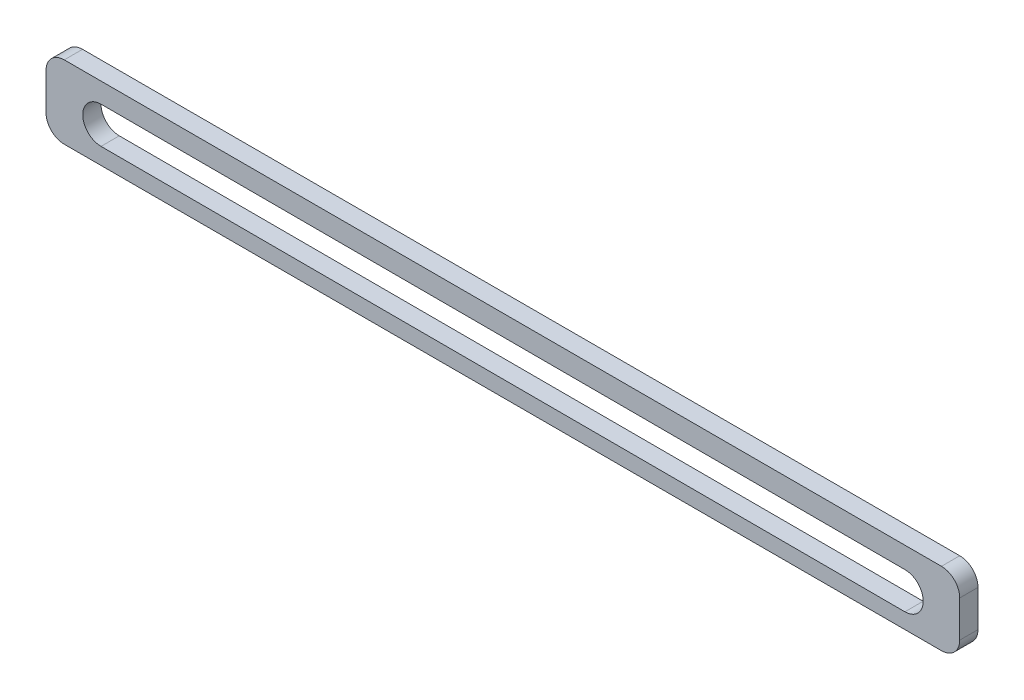
ISO-10303-21;
HEADER;
FILE_DESCRIPTION(('STEP AP214'),'2;1');
FILE_NAME('part.step','',(''),(''),'','','');
FILE_SCHEMA(('AUTOMOTIVE_DESIGN { 1 0 10303 214 1 1 1 1 }'));
ENDSEC;
DATA;
#1=APPLICATION_CONTEXT('core data for automotive mechanical design processes');
#2=APPLICATION_PROTOCOL_DEFINITION('international standard','automotive_design',2000,#1);
#3=PRODUCT_CONTEXT('',#1,'mechanical');
#4=PRODUCT('Part','Part','',(#3));
#5=PRODUCT_RELATED_PRODUCT_CATEGORY('part','',(#4));
#6=PRODUCT_DEFINITION_FORMATION('','',#4);
#7=PRODUCT_DEFINITION_CONTEXT('part definition',#1,'design');
#8=PRODUCT_DEFINITION('design','',#6,#7);
#9=PRODUCT_DEFINITION_SHAPE('','',#8);
#10=(LENGTH_UNIT() NAMED_UNIT(*) SI_UNIT(.MILLI.,.METRE.));
#11=(NAMED_UNIT(*) PLANE_ANGLE_UNIT() SI_UNIT($,.RADIAN.));
#12=(NAMED_UNIT(*) SI_UNIT($,.STERADIAN.) SOLID_ANGLE_UNIT());
#13=UNCERTAINTY_MEASURE_WITH_UNIT(LENGTH_MEASURE(1.E-05),#10,'distance_accuracy_value','');
#14=(GEOMETRIC_REPRESENTATION_CONTEXT(3) GLOBAL_UNCERTAINTY_ASSIGNED_CONTEXT((#13)) GLOBAL_UNIT_ASSIGNED_CONTEXT((#10,
#11,#12)) REPRESENTATION_CONTEXT('',''));
#15=CARTESIAN_POINT('',(0.,0.,0.));
#16=DIRECTION('',(0.,0.,1.));
#17=DIRECTION('',(1.,0.,0.));
#18=AXIS2_PLACEMENT_3D('',#15,#16,#17);
#19=CARTESIAN_POINT('',(290.,123.262074110531,5.));
#20=DIRECTION('',(0.,0.,1.));
#21=DIRECTION('',(1.,0.,0.));
#22=AXIS2_PLACEMENT_3D('',#19,#20,#21);
#23=PLANE('',#22);
#24=CARTESIAN_POINT('',(290.,123.262074110531,5.));
#25=DIRECTION('',(0.,0.,1.));
#26=DIRECTION('',(1.,0.,0.));
#27=AXIS2_PLACEMENT_3D('',#24,#25,#26);
#28=CIRCLE('',#27,10.);
#29=CARTESIAN_POINT('',(290.,113.262074110531,5.));
#30=VERTEX_POINT('',#29);
#31=CARTESIAN_POINT('',(300.,123.262074110531,5.));
#32=VERTEX_POINT('',#31);
#33=EDGE_CURVE('E157',#30,#32,#28,.T.);
#34=ORIENTED_EDGE('',*,*,#33,.T.);
#35=DIRECTION('',(0.,1.,0.));
#36=VECTOR('',#35,1.);
#37=CARTESIAN_POINT('',(300.,143.262074110531,5.));
#38=LINE('',#37,#36);
#39=CARTESIAN_POINT('',(300.,143.262074110531,5.));
#40=VERTEX_POINT('',#39);
#41=EDGE_CURVE('E160',#32,#40,#38,.T.);
#42=ORIENTED_EDGE('',*,*,#41,.T.);
#43=CARTESIAN_POINT('',(290.,143.262074110531,5.));
#44=DIRECTION('',(0.,0.,1.));
#45=DIRECTION('',(-1.,0.,0.));
#46=AXIS2_PLACEMENT_3D('',#43,#44,#45);
#47=CIRCLE('',#46,10.);
#48=CARTESIAN_POINT('',(290.,153.262074110531,5.));
#49=VERTEX_POINT('',#48);
#50=EDGE_CURVE('E163',#40,#49,#47,.T.);
#51=ORIENTED_EDGE('',*,*,#50,.T.);
#52=DIRECTION('',(-1.,0.,0.));
#53=VECTOR('',#52,1.);
#54=CARTESIAN_POINT('',(-190.,153.262074110531,5.));
#55=LINE('',#54,#53);
#56=CARTESIAN_POINT('',(-190.,153.262074110531,5.));
#57=VERTEX_POINT('',#56);
#58=EDGE_CURVE('E165',#49,#57,#55,.T.);
#59=ORIENTED_EDGE('',*,*,#58,.T.);
#60=CARTESIAN_POINT('',(-190.,143.262074110531,5.));
#61=DIRECTION('',(0.,0.,1.));
#62=DIRECTION('',(1.,0.,0.));
#63=AXIS2_PLACEMENT_3D('',#60,#61,#62);
#64=CIRCLE('',#63,9.99999999999999);
#65=CARTESIAN_POINT('',(-200.,143.262074110531,5.));
#66=VERTEX_POINT('',#65);
#67=EDGE_CURVE('E167',#57,#66,#64,.T.);
#68=ORIENTED_EDGE('',*,*,#67,.T.);
#69=DIRECTION('',(0.,-1.,0.));
#70=VECTOR('',#69,1.);
#71=CARTESIAN_POINT('',(-200.,143.262074110531,5.));
#72=LINE('',#71,#70);
#73=CARTESIAN_POINT('',(-200.,123.262074110531,5.));
#74=VERTEX_POINT('',#73);
#75=EDGE_CURVE('E169',#66,#74,#72,.T.);
#76=ORIENTED_EDGE('',*,*,#75,.T.);
#77=CARTESIAN_POINT('',(-190.,123.262074110531,5.));
#78=DIRECTION('',(0.,0.,1.));
#79=DIRECTION('',(1.,0.,0.));
#80=AXIS2_PLACEMENT_3D('',#77,#78,#79);
#81=CIRCLE('',#80,10.);
#82=CARTESIAN_POINT('',(-190.,113.262074110531,5.));
#83=VERTEX_POINT('',#82);
#84=EDGE_CURVE('E171',#74,#83,#81,.T.);
#85=ORIENTED_EDGE('',*,*,#84,.T.);
#86=DIRECTION('',(1.,0.,0.));
#87=VECTOR('',#86,1.);
#88=CARTESIAN_POINT('',(-190.,113.262074110531,5.));
#89=LINE('',#88,#87);
#90=EDGE_CURVE('E173',#83,#30,#89,.T.);
#91=ORIENTED_EDGE('',*,*,#90,.T.);
#92=EDGE_LOOP('',(#34,#42,#51,#59,#68,#76,#85,#91));
#93=FACE_BOUND('',#92,.T.);
#94=DIRECTION('',(0.999999005334886,-0.00141043583263051,0.));
#95=VECTOR('',#94,1.);
#96=CARTESIAN_POINT('',(-169.895525103664,122.322633631603,5.));
#97=LINE('',#96,#95);
#98=CARTESIAN_POINT('',(-169.895525103664,122.322633631603,5.));
#99=VERTEX_POINT('',#98);
#100=CARTESIAN_POINT('',(270.004302633349,121.702182534653,5.));
#101=VERTEX_POINT('',#100);
#102=EDGE_CURVE('E129',#99,#101,#97,.T.);
#103=ORIENTED_EDGE('',*,*,#102,.F.);
#104=CARTESIAN_POINT('',(-169.881420745337,132.322623684951,5.));
#105=DIRECTION('',(0.,0.,1.));
#106=DIRECTION('',(1.,0.,0.));
#107=AXIS2_PLACEMENT_3D('',#104,#105,#106);
#108=CIRCLE('',#107,10.);
#109=CARTESIAN_POINT('',(-169.867316387011,142.3226137383,5.));
#110=VERTEX_POINT('',#109);
#111=EDGE_CURVE('E121',#110,#99,#108,.T.);
#112=ORIENTED_EDGE('',*,*,#111,.F.);
#113=DIRECTION('',(-0.999999005334886,0.00141043583263051,0.));
#114=VECTOR('',#113,1.);
#115=CARTESIAN_POINT('',(-169.867316387011,142.3226137383,5.));
#116=LINE('',#115,#114);
#117=CARTESIAN_POINT('',(270.032511350002,141.702162641351,5.));
#118=VERTEX_POINT('',#117);
#119=EDGE_CURVE('E143',#118,#110,#116,.T.);
#120=ORIENTED_EDGE('',*,*,#119,.F.);
#121=CARTESIAN_POINT('',(270.018406991675,131.702172588002,5.));
#122=DIRECTION('',(0.,0.,1.));
#123=DIRECTION('',(1.,0.,0.));
#124=AXIS2_PLACEMENT_3D('',#121,#122,#123);
#125=CIRCLE('',#124,10.);
#126=EDGE_CURVE('E141',#101,#118,#125,.T.);
#127=ORIENTED_EDGE('',*,*,#126,.F.);
#128=EDGE_LOOP('',(#103,#112,#120,#127));
#129=FACE_BOUND('',#128,.T.);
#130=ADVANCED_FACE('F32',(#93,#129),#23,.T.);
#131=CARTESIAN_POINT('',(290.,123.262074110531,-5.));
#132=DIRECTION('',(0.,0.,1.));
#133=DIRECTION('',(1.,0.,0.));
#134=AXIS2_PLACEMENT_3D('',#131,#132,#133);
#135=PLANE('',#134);
#136=CARTESIAN_POINT('',(290.,123.262074110531,-5.));
#137=DIRECTION('',(0.,0.,1.));
#138=DIRECTION('',(1.,0.,0.));
#139=AXIS2_PLACEMENT_3D('',#136,#137,#138);
#140=CIRCLE('',#139,10.);
#141=CARTESIAN_POINT('',(290.,113.262074110531,-5.));
#142=VERTEX_POINT('',#141);
#143=CARTESIAN_POINT('',(300.,123.262074110531,-5.));
#144=VERTEX_POINT('',#143);
#145=EDGE_CURVE('E137',#142,#144,#140,.T.);
#146=ORIENTED_EDGE('',*,*,#145,.F.);
#147=DIRECTION('',(1.,0.,0.));
#148=VECTOR('',#147,1.);
#149=CARTESIAN_POINT('',(-190.,113.262074110531,-5.));
#150=LINE('',#149,#148);
#151=CARTESIAN_POINT('',(-190.,113.262074110531,-5.));
#152=VERTEX_POINT('',#151);
#153=EDGE_CURVE('E161',#152,#142,#150,.T.);
#154=ORIENTED_EDGE('',*,*,#153,.F.);
#155=CARTESIAN_POINT('',(-190.,123.262074110531,-5.));
#156=DIRECTION('',(0.,0.,1.));
#157=DIRECTION('',(1.,0.,0.));
#158=AXIS2_PLACEMENT_3D('',#155,#156,#157);
#159=CIRCLE('',#158,10.);
#160=CARTESIAN_POINT('',(-200.,123.262074110531,-5.));
#161=VERTEX_POINT('',#160);
#162=EDGE_CURVE('E188',#161,#152,#159,.T.);
#163=ORIENTED_EDGE('',*,*,#162,.F.);
#164=DIRECTION('',(0.,-1.,0.));
#165=VECTOR('',#164,1.);
#166=CARTESIAN_POINT('',(-200.,143.262074110531,-5.));
#167=LINE('',#166,#165);
#168=CARTESIAN_POINT('',(-200.,143.262074110531,-5.));
#169=VERTEX_POINT('',#168);
#170=EDGE_CURVE('E186',#169,#161,#167,.T.);
#171=ORIENTED_EDGE('',*,*,#170,.F.);
#172=CARTESIAN_POINT('',(-190.,143.262074110531,-5.));
#173=DIRECTION('',(0.,0.,1.));
#174=DIRECTION('',(1.,0.,0.));
#175=AXIS2_PLACEMENT_3D('',#172,#173,#174);
#176=CIRCLE('',#175,9.99999999999999);
#177=CARTESIAN_POINT('',(-190.,153.262074110531,-5.));
#178=VERTEX_POINT('',#177);
#179=EDGE_CURVE('E184',#178,#169,#176,.T.);
#180=ORIENTED_EDGE('',*,*,#179,.F.);
#181=DIRECTION('',(-1.,0.,0.));
#182=VECTOR('',#181,1.);
#183=CARTESIAN_POINT('',(-190.,153.262074110531,-5.));
#184=LINE('',#183,#182);
#185=CARTESIAN_POINT('',(290.,153.262074110531,-5.));
#186=VERTEX_POINT('',#185);
#187=EDGE_CURVE('E182',#186,#178,#184,.T.);
#188=ORIENTED_EDGE('',*,*,#187,.F.);
#189=CARTESIAN_POINT('',(290.,143.262074110531,-5.));
#190=DIRECTION('',(0.,0.,1.));
#191=DIRECTION('',(-1.,0.,0.));
#192=AXIS2_PLACEMENT_3D('',#189,#190,#191);
#193=CIRCLE('',#192,10.);
#194=CARTESIAN_POINT('',(300.,143.262074110531,-5.));
#195=VERTEX_POINT('',#194);
#196=EDGE_CURVE('E180',#195,#186,#193,.T.);
#197=ORIENTED_EDGE('',*,*,#196,.F.);
#198=DIRECTION('',(0.,1.,0.));
#199=VECTOR('',#198,1.);
#200=CARTESIAN_POINT('',(300.,143.262074110531,-5.));
#201=LINE('',#200,#199);
#202=EDGE_CURVE('E178',#144,#195,#201,.T.);
#203=ORIENTED_EDGE('',*,*,#202,.F.);
#204=EDGE_LOOP('',(#146,#154,#163,#171,#180,#188,#197,#203));
#205=FACE_BOUND('',#204,.T.);
#206=CARTESIAN_POINT('',(-169.881420745337,132.322623684951,-5.));
#207=DIRECTION('',(0.,0.,1.));
#208=DIRECTION('',(1.,0.,0.));
#209=AXIS2_PLACEMENT_3D('',#206,#207,#208);
#210=CIRCLE('',#209,10.);
#211=CARTESIAN_POINT('',(-169.867316387011,142.3226137383,-5.));
#212=VERTEX_POINT('',#211);
#213=CARTESIAN_POINT('',(-169.895525103664,122.322633631603,-5.));
#214=VERTEX_POINT('',#213);
#215=EDGE_CURVE('E55',#212,#214,#210,.T.);
#216=ORIENTED_EDGE('',*,*,#215,.T.);
#217=DIRECTION('',(0.999999005334886,-0.00141043583263051,0.));
#218=VECTOR('',#217,1.);
#219=CARTESIAN_POINT('',(-169.895525103664,122.322633631603,-5.));
#220=LINE('',#219,#218);
#221=CARTESIAN_POINT('',(270.004302633349,121.702182534653,-5.));
#222=VERTEX_POINT('',#221);
#223=EDGE_CURVE('E136',#214,#222,#220,.T.);
#224=ORIENTED_EDGE('',*,*,#223,.T.);
#225=CARTESIAN_POINT('',(270.018406991675,131.702172588002,-5.));
#226=DIRECTION('',(0.,0.,1.));
#227=DIRECTION('',(1.,0.,0.));
#228=AXIS2_PLACEMENT_3D('',#225,#226,#227);
#229=CIRCLE('',#228,10.);
#230=CARTESIAN_POINT('',(270.032511350002,141.702162641351,-5.));
#231=VERTEX_POINT('',#230);
#232=EDGE_CURVE('E149',#222,#231,#229,.T.);
#233=ORIENTED_EDGE('',*,*,#232,.T.);
#234=DIRECTION('',(-0.999999005334886,0.00141043583263051,0.));
#235=VECTOR('',#234,1.);
#236=CARTESIAN_POINT('',(-169.867316387011,142.3226137383,-5.));
#237=LINE('',#236,#235);
#238=EDGE_CURVE('E130',#231,#212,#237,.T.);
#239=ORIENTED_EDGE('',*,*,#238,.T.);
#240=EDGE_LOOP('',(#216,#224,#233,#239));
#241=FACE_BOUND('',#240,.T.);
#242=ADVANCED_FACE('F218',(#205,#241),#135,.F.);
#243=CARTESIAN_POINT('',(290.,123.262074110531,5.));
#244=DIRECTION('',(0.,0.,-1.));
#245=DIRECTION('',(-1.,0.,0.));
#246=AXIS2_PLACEMENT_3D('',#243,#244,#245);
#247=CYLINDRICAL_SURFACE('',#246,10.);
#248=ORIENTED_EDGE('',*,*,#145,.T.);
#249=DIRECTION('',(0.,0.,-1.));
#250=VECTOR('',#249,1.);
#251=CARTESIAN_POINT('',(300.,123.262074110531,5.));
#252=LINE('',#251,#250);
#253=EDGE_CURVE('E11',#32,#144,#252,.T.);
#254=ORIENTED_EDGE('',*,*,#253,.F.);
#255=ORIENTED_EDGE('',*,*,#33,.F.);
#256=DIRECTION('',(0.,0.,-1.));
#257=VECTOR('',#256,1.);
#258=CARTESIAN_POINT('',(290.,113.262074110531,5.));
#259=LINE('',#258,#257);
#260=EDGE_CURVE('E175',#30,#142,#259,.T.);
#261=ORIENTED_EDGE('',*,*,#260,.T.);
#262=EDGE_LOOP('',(#248,#254,#255,#261));
#263=FACE_BOUND('',#262,.T.);
#264=ADVANCED_FACE('F34',(#263),#247,.T.);
#265=CARTESIAN_POINT('',(300.,143.262074110531,5.));
#266=DIRECTION('',(-1.,0.,0.));
#267=DIRECTION('',(0.,0.,1.));
#268=AXIS2_PLACEMENT_3D('',#265,#266,#267);
#269=PLANE('',#268);
#270=ORIENTED_EDGE('',*,*,#202,.T.);
#271=DIRECTION('',(0.,0.,-1.));
#272=VECTOR('',#271,1.);
#273=CARTESIAN_POINT('',(300.,143.262074110531,5.));
#274=LINE('',#273,#272);
#275=EDGE_CURVE('E40',#40,#195,#274,.T.);
#276=ORIENTED_EDGE('',*,*,#275,.F.);
#277=ORIENTED_EDGE('',*,*,#41,.F.);
#278=ORIENTED_EDGE('',*,*,#253,.T.);
#279=EDGE_LOOP('',(#270,#276,#277,#278));
#280=FACE_BOUND('',#279,.T.);
#281=ADVANCED_FACE('F235',(#280),#269,.F.);
#282=CARTESIAN_POINT('',(290.,143.262074110531,5.));
#283=DIRECTION('',(0.,0.,-1.));
#284=DIRECTION('',(-1.,0.,0.));
#285=AXIS2_PLACEMENT_3D('',#282,#283,#284);
#286=CYLINDRICAL_SURFACE('',#285,10.);
#287=ORIENTED_EDGE('',*,*,#196,.T.);
#288=DIRECTION('',(0.,0.,-1.));
#289=VECTOR('',#288,1.);
#290=CARTESIAN_POINT('',(290.,153.262074110531,5.));
#291=LINE('',#290,#289);
#292=EDGE_CURVE('E205',#49,#186,#291,.T.);
#293=ORIENTED_EDGE('',*,*,#292,.F.);
#294=ORIENTED_EDGE('',*,*,#50,.F.);
#295=ORIENTED_EDGE('',*,*,#275,.T.);
#296=EDGE_LOOP('',(#287,#293,#294,#295));
#297=FACE_BOUND('',#296,.T.);
#298=ADVANCED_FACE('F212',(#297),#286,.T.);
#299=CARTESIAN_POINT('',(-190.,153.262074110531,5.));
#300=DIRECTION('',(0.,-1.,0.));
#301=DIRECTION('',(1.,0.,0.));
#302=AXIS2_PLACEMENT_3D('',#299,#300,#301);
#303=PLANE('',#302);
#304=ORIENTED_EDGE('',*,*,#187,.T.);
#305=DIRECTION('',(0.,0.,-1.));
#306=VECTOR('',#305,1.);
#307=CARTESIAN_POINT('',(-190.,153.262074110531,5.));
#308=LINE('',#307,#306);
#309=EDGE_CURVE('E202',#57,#178,#308,.T.);
#310=ORIENTED_EDGE('',*,*,#309,.F.);
#311=ORIENTED_EDGE('',*,*,#58,.F.);
#312=ORIENTED_EDGE('',*,*,#292,.T.);
#313=EDGE_LOOP('',(#304,#310,#311,#312));
#314=FACE_BOUND('',#313,.T.);
#315=ADVANCED_FACE('F224',(#314),#303,.F.);
#316=CARTESIAN_POINT('',(-190.,143.262074110531,5.));
#317=DIRECTION('',(0.,0.,-1.));
#318=DIRECTION('',(-1.,0.,0.));
#319=AXIS2_PLACEMENT_3D('',#316,#317,#318);
#320=CYLINDRICAL_SURFACE('',#319,9.99999999999999);
#321=ORIENTED_EDGE('',*,*,#179,.T.);
#322=DIRECTION('',(0.,0.,-1.));
#323=VECTOR('',#322,1.);
#324=CARTESIAN_POINT('',(-200.,143.262074110531,5.));
#325=LINE('',#324,#323);
#326=EDGE_CURVE('E199',#66,#169,#325,.T.);
#327=ORIENTED_EDGE('',*,*,#326,.F.);
#328=ORIENTED_EDGE('',*,*,#67,.F.);
#329=ORIENTED_EDGE('',*,*,#309,.T.);
#330=EDGE_LOOP('',(#321,#327,#328,#329));
#331=FACE_BOUND('',#330,.T.);
#332=ADVANCED_FACE('F228',(#331),#320,.T.);
#333=CARTESIAN_POINT('',(-200.,143.262074110531,5.));
#334=DIRECTION('',(1.,0.,0.));
#335=DIRECTION('',(0.,0.,-1.));
#336=AXIS2_PLACEMENT_3D('',#333,#334,#335);
#337=PLANE('',#336);
#338=ORIENTED_EDGE('',*,*,#170,.T.);
#339=DIRECTION('',(0.,0.,-1.));
#340=VECTOR('',#339,1.);
#341=CARTESIAN_POINT('',(-200.,123.262074110531,5.));
#342=LINE('',#341,#340);
#343=EDGE_CURVE('E196',#74,#161,#342,.T.);
#344=ORIENTED_EDGE('',*,*,#343,.F.);
#345=ORIENTED_EDGE('',*,*,#75,.F.);
#346=ORIENTED_EDGE('',*,*,#326,.T.);
#347=EDGE_LOOP('',(#338,#344,#345,#346));
#348=FACE_BOUND('',#347,.T.);
#349=ADVANCED_FACE('F248',(#348),#337,.F.);
#350=CARTESIAN_POINT('',(-190.,123.262074110531,5.));
#351=DIRECTION('',(0.,0.,-1.));
#352=DIRECTION('',(-1.,0.,0.));
#353=AXIS2_PLACEMENT_3D('',#350,#351,#352);
#354=CYLINDRICAL_SURFACE('',#353,10.);
#355=ORIENTED_EDGE('',*,*,#162,.T.);
#356=DIRECTION('',(0.,0.,-1.));
#357=VECTOR('',#356,1.);
#358=CARTESIAN_POINT('',(-190.,113.262074110531,5.));
#359=LINE('',#358,#357);
#360=EDGE_CURVE('E193',#83,#152,#359,.T.);
#361=ORIENTED_EDGE('',*,*,#360,.F.);
#362=ORIENTED_EDGE('',*,*,#84,.F.);
#363=ORIENTED_EDGE('',*,*,#343,.T.);
#364=EDGE_LOOP('',(#355,#361,#362,#363));
#365=FACE_BOUND('',#364,.T.);
#366=ADVANCED_FACE('F246',(#365),#354,.T.);
#367=CARTESIAN_POINT('',(-190.,113.262074110531,5.));
#368=DIRECTION('',(0.,1.,0.));
#369=DIRECTION('',(0.,0.,1.));
#370=AXIS2_PLACEMENT_3D('',#367,#368,#369);
#371=PLANE('',#370);
#372=ORIENTED_EDGE('',*,*,#153,.T.);
#373=ORIENTED_EDGE('',*,*,#260,.F.);
#374=ORIENTED_EDGE('',*,*,#90,.F.);
#375=ORIENTED_EDGE('',*,*,#360,.T.);
#376=EDGE_LOOP('',(#372,#373,#374,#375));
#377=FACE_BOUND('',#376,.T.);
#378=ADVANCED_FACE('F241',(#377),#371,.F.);
#379=CARTESIAN_POINT('',(-169.881420745337,132.322623684951,5.));
#380=DIRECTION('',(0.,0.,-1.));
#381=DIRECTION('',(-1.,0.,0.));
#382=AXIS2_PLACEMENT_3D('',#379,#380,#381);
#383=CYLINDRICAL_SURFACE('',#382,10.);
#384=ORIENTED_EDGE('',*,*,#215,.F.);
#385=DIRECTION('',(0.,0.,-1.));
#386=VECTOR('',#385,1.);
#387=CARTESIAN_POINT('',(-169.867316387011,142.3226137383,5.));
#388=LINE('',#387,#386);
#389=EDGE_CURVE('E125',#110,#212,#388,.T.);
#390=ORIENTED_EDGE('',*,*,#389,.F.);
#391=ORIENTED_EDGE('',*,*,#111,.T.);
#392=DIRECTION('',(0.,0.,-1.));
#393=VECTOR('',#392,1.);
#394=CARTESIAN_POINT('',(-169.895525103664,122.322633631603,5.));
#395=LINE('',#394,#393);
#396=EDGE_CURVE('E124',#99,#214,#395,.T.);
#397=ORIENTED_EDGE('',*,*,#396,.T.);
#398=EDGE_LOOP('',(#384,#390,#391,#397));
#399=FACE_BOUND('',#398,.T.);
#400=ADVANCED_FACE('F123',(#399),#383,.F.);
#401=CARTESIAN_POINT('',(-169.895525103664,122.322633631603,5.));
#402=DIRECTION('',(0.00141043583263051,0.999999005334886,0.));
#403=DIRECTION('',(-0.999999005334886,0.00141043583263051,0.));
#404=AXIS2_PLACEMENT_3D('',#401,#402,#403);
#405=PLANE('',#404);
#406=ORIENTED_EDGE('',*,*,#223,.F.);
#407=ORIENTED_EDGE('',*,*,#396,.F.);
#408=ORIENTED_EDGE('',*,*,#102,.T.);
#409=DIRECTION('',(0.,0.,-1.));
#410=VECTOR('',#409,1.);
#411=CARTESIAN_POINT('',(270.004302633349,121.702182534653,5.));
#412=LINE('',#411,#410);
#413=EDGE_CURVE('E138',#101,#222,#412,.T.);
#414=ORIENTED_EDGE('',*,*,#413,.T.);
#415=EDGE_LOOP('',(#406,#407,#408,#414));
#416=FACE_BOUND('',#415,.T.);
#417=ADVANCED_FACE('F133',(#416),#405,.T.);
#418=CARTESIAN_POINT('',(270.018406991675,131.702172588002,5.));
#419=DIRECTION('',(0.,0.,-1.));
#420=DIRECTION('',(-1.,0.,0.));
#421=AXIS2_PLACEMENT_3D('',#418,#419,#420);
#422=CYLINDRICAL_SURFACE('',#421,10.);
#423=ORIENTED_EDGE('',*,*,#232,.F.);
#424=ORIENTED_EDGE('',*,*,#413,.F.);
#425=ORIENTED_EDGE('',*,*,#126,.T.);
#426=DIRECTION('',(0.,0.,-1.));
#427=VECTOR('',#426,1.);
#428=CARTESIAN_POINT('',(270.032511350002,141.702162641351,5.));
#429=LINE('',#428,#427);
#430=EDGE_CURVE('E47',#118,#231,#429,.T.);
#431=ORIENTED_EDGE('',*,*,#430,.T.);
#432=EDGE_LOOP('',(#423,#424,#425,#431));
#433=FACE_BOUND('',#432,.T.);
#434=ADVANCED_FACE('F273',(#433),#422,.F.);
#435=CARTESIAN_POINT('',(-169.867316387011,142.3226137383,5.));
#436=DIRECTION('',(-0.00141043583263051,-0.999999005334886,0.));
#437=DIRECTION('',(0.999999005334886,-0.00141043583263051,0.));
#438=AXIS2_PLACEMENT_3D('',#435,#436,#437);
#439=PLANE('',#438);
#440=ORIENTED_EDGE('',*,*,#238,.F.);
#441=ORIENTED_EDGE('',*,*,#430,.F.);
#442=ORIENTED_EDGE('',*,*,#119,.T.);
#443=ORIENTED_EDGE('',*,*,#389,.T.);
#444=EDGE_LOOP('',(#440,#441,#442,#443));
#445=FACE_BOUND('',#444,.T.);
#446=ADVANCED_FACE('F277',(#445),#439,.T.);
#447=CLOSED_SHELL('',(#130,#242,#264,#281,#298,#315,#332,#349,#366,#378,#400,#417,#434,#446));
#448=MANIFOLD_SOLID_BREP('B2',#447);
#449=ADVANCED_BREP_SHAPE_REPRESENTATION('',(#18,#448),#14);
#450=SHAPE_DEFINITION_REPRESENTATION(#9,#449);
ENDSEC;
END-ISO-10303-21;
